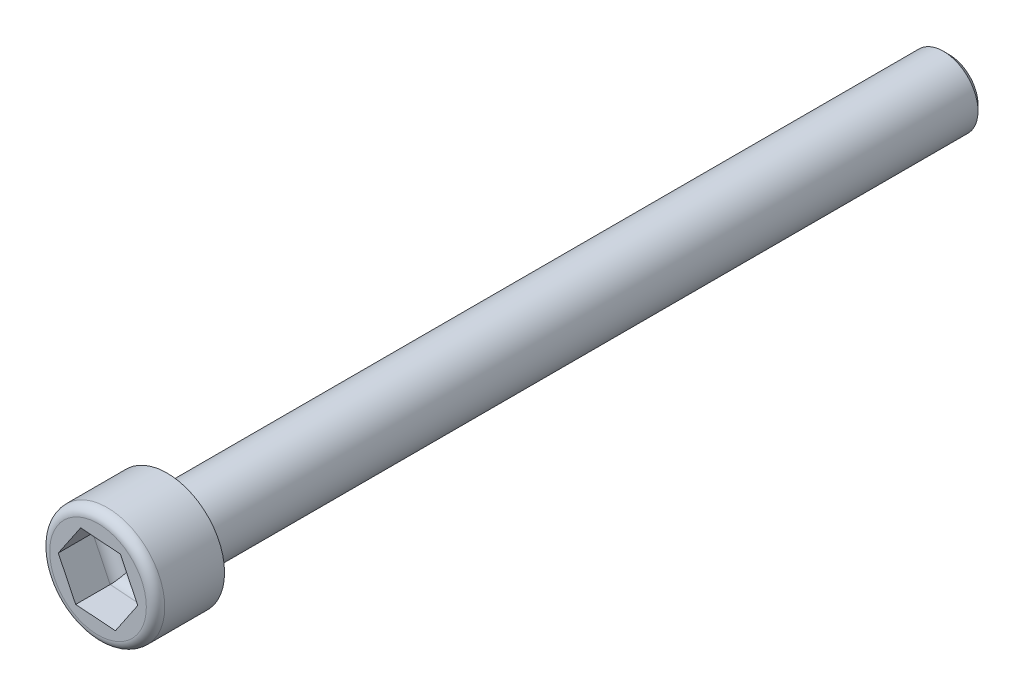
ISO-10303-21;
HEADER;
FILE_DESCRIPTION(('STEP AP214'),'2;1');
FILE_NAME('part.step','',(''),(''),'','','');
FILE_SCHEMA(('AUTOMOTIVE_DESIGN { 1 0 10303 214 1 1 1 1 }'));
ENDSEC;
DATA;
#1=APPLICATION_CONTEXT('core data for automotive mechanical design processes');
#2=APPLICATION_PROTOCOL_DEFINITION('international standard','automotive_design',2000,#1);
#3=PRODUCT_CONTEXT('',#1,'mechanical');
#4=PRODUCT('Part','Part','',(#3));
#5=PRODUCT_RELATED_PRODUCT_CATEGORY('part','',(#4));
#6=PRODUCT_DEFINITION_FORMATION('','',#4);
#7=PRODUCT_DEFINITION_CONTEXT('part definition',#1,'design');
#8=PRODUCT_DEFINITION('design','',#6,#7);
#9=PRODUCT_DEFINITION_SHAPE('','',#8);
#10=(LENGTH_UNIT() NAMED_UNIT(*) SI_UNIT(.MILLI.,.METRE.));
#11=(NAMED_UNIT(*) PLANE_ANGLE_UNIT() SI_UNIT($,.RADIAN.));
#12=(NAMED_UNIT(*) SI_UNIT($,.STERADIAN.) SOLID_ANGLE_UNIT());
#13=UNCERTAINTY_MEASURE_WITH_UNIT(LENGTH_MEASURE(1.E-05),#10,'distance_accuracy_value','');
#14=(GEOMETRIC_REPRESENTATION_CONTEXT(3) GLOBAL_UNCERTAINTY_ASSIGNED_CONTEXT((#13)) GLOBAL_UNIT_ASSIGNED_CONTEXT((#10,
#11,#12)) REPRESENTATION_CONTEXT('',''));
#15=CARTESIAN_POINT('',(0.,0.,0.));
#16=DIRECTION('',(0.,0.,1.));
#17=DIRECTION('',(1.,0.,0.));
#18=AXIS2_PLACEMENT_3D('',#15,#16,#17);
#19=CARTESIAN_POINT('',(0.,0.,34.));
#20=DIRECTION('',(0.,0.,-1.));
#21=DIRECTION('',(-1.,0.,0.));
#22=AXIS2_PLACEMENT_3D('',#19,#20,#21);
#23=CYLINDRICAL_SURFACE('',#22,1.5);
#24=CARTESIAN_POINT('',(0.,0.,0.25));
#25=DIRECTION('',(0.,0.,1.));
#26=DIRECTION('',(1.,0.,0.));
#27=AXIS2_PLACEMENT_3D('',#24,#25,#26);
#28=CIRCLE('',#27,1.5);
#29=CARTESIAN_POINT('',(1.5,0.,0.25));
#30=VERTEX_POINT('',#29);
#31=EDGE_CURVE('E155',#30,#30,#28,.T.);
#32=ORIENTED_EDGE('',*,*,#31,.T.);
#33=EDGE_LOOP('',(#32));
#34=FACE_BOUND('',#33,.T.);
#35=CARTESIAN_POINT('',(0.,0.,34.));
#36=DIRECTION('',(0.,0.,1.));
#37=DIRECTION('',(1.,0.,0.));
#38=AXIS2_PLACEMENT_3D('',#35,#36,#37);
#39=CIRCLE('',#38,1.5);
#40=CARTESIAN_POINT('',(1.5,0.,34.));
#41=VERTEX_POINT('',#40);
#42=EDGE_CURVE('E146',#41,#41,#39,.T.);
#43=ORIENTED_EDGE('',*,*,#42,.F.);
#44=EDGE_LOOP('',(#43));
#45=FACE_BOUND('',#44,.T.);
#46=ADVANCED_FACE('F33',(#34,#45),#23,.T.);
#47=CARTESIAN_POINT('',(0.,0.,0.));
#48=DIRECTION('',(0.,0.,1.));
#49=DIRECTION('',(1.,0.,0.));
#50=AXIS2_PLACEMENT_3D('',#47,#48,#49);
#51=PLANE('',#50);
#52=CARTESIAN_POINT('',(0.,0.,0.));
#53=DIRECTION('',(0.,0.,1.));
#54=DIRECTION('',(1.,0.,0.));
#55=AXIS2_PLACEMENT_3D('',#52,#53,#54);
#56=CIRCLE('',#55,1.25);
#57=CARTESIAN_POINT('',(1.25,0.,0.));
#58=VERTEX_POINT('',#57);
#59=EDGE_CURVE('E158',#58,#58,#56,.F.);
#60=ORIENTED_EDGE('',*,*,#59,.T.);
#61=EDGE_LOOP('',(#60));
#62=FACE_BOUND('',#61,.T.);
#63=ADVANCED_FACE('F248',(#62),#51,.F.);
#64=CARTESIAN_POINT('',(0.,0.,34.));
#65=DIRECTION('',(0.,0.,1.));
#66=DIRECTION('',(1.,0.,0.));
#67=AXIS2_PLACEMENT_3D('',#64,#65,#66);
#68=PLANE('',#67);
#69=CARTESIAN_POINT('',(0.,0.,34.));
#70=DIRECTION('',(0.,0.,1.));
#71=DIRECTION('',(1.,0.,0.));
#72=AXIS2_PLACEMENT_3D('',#69,#70,#71);
#73=CIRCLE('',#72,2.5);
#74=CARTESIAN_POINT('',(2.5,0.,34.));
#75=VERTEX_POINT('',#74);
#76=EDGE_CURVE('E137',#75,#75,#73,.T.);
#77=ORIENTED_EDGE('',*,*,#76,.F.);
#78=EDGE_LOOP('',(#77));
#79=FACE_BOUND('',#78,.T.);
#80=ORIENTED_EDGE('',*,*,#42,.T.);
#81=EDGE_LOOP('',(#80));
#82=FACE_BOUND('',#81,.T.);
#83=ADVANCED_FACE('F254',(#79,#82),#68,.F.);
#84=CARTESIAN_POINT('',(0.,0.,37.));
#85=DIRECTION('',(0.,0.,-1.));
#86=DIRECTION('',(-1.,0.,0.));
#87=AXIS2_PLACEMENT_3D('',#84,#85,#86);
#88=CYLINDRICAL_SURFACE('',#87,2.5);
#89=CARTESIAN_POINT('',(0.,0.,36.6));
#90=DIRECTION('',(0.,0.,1.));
#91=DIRECTION('',(1.,0.,0.));
#92=AXIS2_PLACEMENT_3D('',#89,#90,#91);
#93=CIRCLE('',#92,2.5);
#94=CARTESIAN_POINT('',(2.5,0.,36.6));
#95=VERTEX_POINT('',#94);
#96=EDGE_CURVE('E152',#95,#95,#93,.F.);
#97=ORIENTED_EDGE('',*,*,#96,.T.);
#98=EDGE_LOOP('',(#97));
#99=FACE_BOUND('',#98,.T.);
#100=ORIENTED_EDGE('',*,*,#76,.T.);
#101=EDGE_LOOP('',(#100));
#102=FACE_BOUND('',#101,.T.);
#103=ADVANCED_FACE('F310',(#99,#102),#88,.T.);
#104=CARTESIAN_POINT('',(0.,0.,37.));
#105=DIRECTION('',(0.,0.,1.));
#106=DIRECTION('',(1.,0.,0.));
#107=AXIS2_PLACEMENT_3D('',#104,#105,#106);
#108=PLANE('',#107);
#109=CARTESIAN_POINT('',(0.,0.,37.));
#110=DIRECTION('',(0.,0.,1.));
#111=DIRECTION('',(1.,0.,0.));
#112=AXIS2_PLACEMENT_3D('',#109,#110,#111);
#113=CIRCLE('',#112,2.1);
#114=CARTESIAN_POINT('',(2.1,0.,37.));
#115=VERTEX_POINT('',#114);
#116=EDGE_CURVE('E149',#115,#115,#113,.T.);
#117=ORIENTED_EDGE('',*,*,#116,.T.);
#118=EDGE_LOOP('',(#117));
#119=FACE_BOUND('',#118,.T.);
#120=DIRECTION('',(0.560793935246234,0.827955410750508,0.));
#121=VECTOR('',#120,1.);
#122=CARTESIAN_POINT('',(0.756271321914277,-1.55822132178007,37.));
#123=LINE('',#122,#121);
#124=CARTESIAN_POINT('',(0.756271321914277,-1.55822132178007,37.));
#125=VERTEX_POINT('',#124);
#126=CARTESIAN_POINT('',(1.72759491033725,-0.124160483958632,37.));
#127=VERTEX_POINT('',#126);
#128=EDGE_CURVE('E119',#125,#127,#123,.T.);
#129=ORIENTED_EDGE('',*,*,#128,.F.);
#130=DIRECTION('',(0.997427386533836,-0.0716840888362304,0.));
#131=VECTOR('',#130,1.);
#132=CARTESIAN_POINT('',(-0.971323588422969,-1.43406083782144,37.));
#133=LINE('',#132,#131);
#134=CARTESIAN_POINT('',(-0.971323588422969,-1.43406083782144,37.));
#135=VERTEX_POINT('',#134);
#136=EDGE_CURVE('E132',#135,#125,#133,.T.);
#137=ORIENTED_EDGE('',*,*,#136,.F.);
#138=DIRECTION('',(0.436633451287602,-0.899639499586738,0.));
#139=VECTOR('',#138,1.);
#140=CARTESIAN_POINT('',(-1.72759491033725,0.124160483958632,37.));
#141=LINE('',#140,#139);
#142=CARTESIAN_POINT('',(-1.72759491033725,0.124160483958632,37.));
#143=VERTEX_POINT('',#142);
#144=EDGE_CURVE('E126',#143,#135,#141,.T.);
#145=ORIENTED_EDGE('',*,*,#144,.F.);
#146=DIRECTION('',(-0.560793935246234,-0.827955410750508,0.));
#147=VECTOR('',#146,1.);
#148=CARTESIAN_POINT('',(-0.756271321914277,1.55822132178007,37.));
#149=LINE('',#148,#147);
#150=CARTESIAN_POINT('',(-0.756271321914277,1.55822132178007,37.));
#151=VERTEX_POINT('',#150);
#152=EDGE_CURVE('E124',#151,#143,#149,.T.);
#153=ORIENTED_EDGE('',*,*,#152,.F.);
#154=DIRECTION('',(-0.997427386533837,0.0716840888362305,0.));
#155=VECTOR('',#154,1.);
#156=CARTESIAN_POINT('',(0.971323588422968,1.43406083782144,37.));
#157=LINE('',#156,#155);
#158=CARTESIAN_POINT('',(0.971323588422968,1.43406083782144,37.));
#159=VERTEX_POINT('',#158);
#160=EDGE_CURVE('E107',#159,#151,#157,.T.);
#161=ORIENTED_EDGE('',*,*,#160,.F.);
#162=DIRECTION('',(-0.436633451287602,0.899639499586738,0.));
#163=VECTOR('',#162,1.);
#164=CARTESIAN_POINT('',(1.72759491033725,-0.124160483958632,37.));
#165=LINE('',#164,#163);
#166=EDGE_CURVE('E114',#127,#159,#165,.T.);
#167=ORIENTED_EDGE('',*,*,#166,.F.);
#168=EDGE_LOOP('',(#129,#137,#145,#153,#161,#167));
#169=FACE_BOUND('',#168,.T.);
#170=ADVANCED_FACE('F121',(#119,#169),#108,.T.);
#171=CARTESIAN_POINT('',(0.756271321914277,-1.55822132178007,35.));
#172=DIRECTION('',(0.827955410750508,-0.560793935246234,0.));
#173=DIRECTION('',(0.560793935246234,0.827955410750508,0.));
#174=AXIS2_PLACEMENT_3D('',#171,#172,#173);
#175=PLANE('',#174);
#176=DIRECTION('',(0.,0.,1.));
#177=VECTOR('',#176,1.);
#178=CARTESIAN_POINT('',(1.72759491033725,-0.124160483958632,35.));
#179=LINE('',#178,#177);
#180=CARTESIAN_POINT('',(1.72759491033725,-0.124160483958632,35.5));
#181=VERTEX_POINT('',#180);
#182=EDGE_CURVE('E111',#181,#127,#179,.T.);
#183=ORIENTED_EDGE('',*,*,#182,.F.);
#184=DIRECTION('',(0.560793935246234,0.827955410750508,0.));
#185=VECTOR('',#184,1.);
#186=CARTESIAN_POINT('',(0.756271321914277,-1.55822132178007,35.5));
#187=LINE('',#186,#185);
#188=CARTESIAN_POINT('',(0.756271321914277,-1.55822132178007,35.5));
#189=VERTEX_POINT('',#188);
#190=EDGE_CURVE('E11',#181,#189,#187,.F.);
#191=ORIENTED_EDGE('',*,*,#190,.T.);
#192=DIRECTION('',(0.,0.,1.));
#193=VECTOR('',#192,1.);
#194=CARTESIAN_POINT('',(0.756271321914277,-1.55822132178007,35.));
#195=LINE('',#194,#193);
#196=EDGE_CURVE('E135',#189,#125,#195,.T.);
#197=ORIENTED_EDGE('',*,*,#196,.T.);
#198=ORIENTED_EDGE('',*,*,#128,.T.);
#199=EDGE_LOOP('',(#183,#191,#197,#198));
#200=FACE_BOUND('',#199,.T.);
#201=ADVANCED_FACE('F202',(#200),#175,.F.);
#202=CARTESIAN_POINT('',(-0.971323588422969,-1.43406083782144,35.));
#203=DIRECTION('',(-0.0716840888362304,-0.997427386533837,0.));
#204=DIRECTION('',(0.997427386533837,-0.0716840888362304,0.));
#205=AXIS2_PLACEMENT_3D('',#202,#203,#204);
#206=PLANE('',#205);
#207=ORIENTED_EDGE('',*,*,#196,.F.);
#208=DIRECTION('',(0.997427386533837,-0.0716840888362304,0.));
#209=VECTOR('',#208,1.);
#210=CARTESIAN_POINT('',(-0.971323588422969,-1.43406083782144,35.5));
#211=LINE('',#210,#209);
#212=CARTESIAN_POINT('',(-0.971323588422969,-1.43406083782144,35.5));
#213=VERTEX_POINT('',#212);
#214=EDGE_CURVE('E174',#189,#213,#211,.F.);
#215=ORIENTED_EDGE('',*,*,#214,.T.);
#216=DIRECTION('',(0.,0.,1.));
#217=VECTOR('',#216,1.);
#218=CARTESIAN_POINT('',(-0.971323588422969,-1.43406083782144,35.));
#219=LINE('',#218,#217);
#220=EDGE_CURVE('E138',#213,#135,#219,.T.);
#221=ORIENTED_EDGE('',*,*,#220,.T.);
#222=ORIENTED_EDGE('',*,*,#136,.T.);
#223=EDGE_LOOP('',(#207,#215,#221,#222));
#224=FACE_BOUND('',#223,.T.);
#225=ADVANCED_FACE('F207',(#224),#206,.F.);
#226=CARTESIAN_POINT('',(-1.72759491033725,0.124160483958632,35.));
#227=DIRECTION('',(-0.899639499586738,-0.436633451287602,0.));
#228=DIRECTION('',(0.436633451287602,-0.899639499586739,0.));
#229=AXIS2_PLACEMENT_3D('',#226,#227,#228);
#230=PLANE('',#229);
#231=ORIENTED_EDGE('',*,*,#220,.F.);
#232=DIRECTION('',(0.436633451287602,-0.899639499586739,0.));
#233=VECTOR('',#232,1.);
#234=CARTESIAN_POINT('',(-1.72759491033725,0.124160483958632,35.5));
#235=LINE('',#234,#233);
#236=CARTESIAN_POINT('',(-1.72759491033725,0.124160483958632,35.5));
#237=VERTEX_POINT('',#236);
#238=EDGE_CURVE('E177',#213,#237,#235,.F.);
#239=ORIENTED_EDGE('',*,*,#238,.T.);
#240=DIRECTION('',(0.,0.,1.));
#241=VECTOR('',#240,1.);
#242=CARTESIAN_POINT('',(-1.72759491033725,0.124160483958632,35.));
#243=LINE('',#242,#241);
#244=EDGE_CURVE('E140',#237,#143,#243,.T.);
#245=ORIENTED_EDGE('',*,*,#244,.T.);
#246=ORIENTED_EDGE('',*,*,#144,.T.);
#247=EDGE_LOOP('',(#231,#239,#245,#246));
#248=FACE_BOUND('',#247,.T.);
#249=ADVANCED_FACE('F211',(#248),#230,.F.);
#250=CARTESIAN_POINT('',(-0.756271321914277,1.55822132178007,35.));
#251=DIRECTION('',(-0.827955410750508,0.560793935246234,0.));
#252=DIRECTION('',(-0.560793935246234,-0.827955410750508,0.));
#253=AXIS2_PLACEMENT_3D('',#250,#251,#252);
#254=PLANE('',#253);
#255=ORIENTED_EDGE('',*,*,#244,.F.);
#256=DIRECTION('',(-0.560793935246234,-0.827955410750508,0.));
#257=VECTOR('',#256,1.);
#258=CARTESIAN_POINT('',(-0.756271321914277,1.55822132178007,35.5));
#259=LINE('',#258,#257);
#260=CARTESIAN_POINT('',(-0.756271321914277,1.55822132178007,35.5));
#261=VERTEX_POINT('',#260);
#262=EDGE_CURVE('E179',#237,#261,#259,.F.);
#263=ORIENTED_EDGE('',*,*,#262,.T.);
#264=DIRECTION('',(0.,0.,1.));
#265=VECTOR('',#264,1.);
#266=CARTESIAN_POINT('',(-0.756271321914277,1.55822132178007,35.));
#267=LINE('',#266,#265);
#268=EDGE_CURVE('E110',#261,#151,#267,.T.);
#269=ORIENTED_EDGE('',*,*,#268,.T.);
#270=ORIENTED_EDGE('',*,*,#152,.T.);
#271=EDGE_LOOP('',(#255,#263,#269,#270));
#272=FACE_BOUND('',#271,.T.);
#273=ADVANCED_FACE('F215',(#272),#254,.F.);
#274=CARTESIAN_POINT('',(0.971323588422968,1.43406083782144,35.));
#275=DIRECTION('',(0.0716840888362305,0.997427386533837,0.));
#276=DIRECTION('',(-0.997427386533837,0.0716840888362305,0.));
#277=AXIS2_PLACEMENT_3D('',#274,#275,#276);
#278=PLANE('',#277);
#279=ORIENTED_EDGE('',*,*,#268,.F.);
#280=DIRECTION('',(-0.997427386533837,0.0716840888362305,0.));
#281=VECTOR('',#280,1.);
#282=CARTESIAN_POINT('',(0.971323588422968,1.43406083782144,35.5));
#283=LINE('',#282,#281);
#284=CARTESIAN_POINT('',(0.971323588422968,1.43406083782144,35.5));
#285=VERTEX_POINT('',#284);
#286=EDGE_CURVE('E57',#261,#285,#283,.F.);
#287=ORIENTED_EDGE('',*,*,#286,.T.);
#288=DIRECTION('',(0.,0.,1.));
#289=VECTOR('',#288,1.);
#290=CARTESIAN_POINT('',(0.971323588422968,1.43406083782144,35.));
#291=LINE('',#290,#289);
#292=EDGE_CURVE('E103',#285,#159,#291,.T.);
#293=ORIENTED_EDGE('',*,*,#292,.T.);
#294=ORIENTED_EDGE('',*,*,#160,.T.);
#295=EDGE_LOOP('',(#279,#287,#293,#294));
#296=FACE_BOUND('',#295,.T.);
#297=ADVANCED_FACE('F105',(#296),#278,.F.);
#298=CARTESIAN_POINT('',(1.72759491033725,-0.124160483958632,35.));
#299=DIRECTION('',(0.899639499586738,0.436633451287602,0.));
#300=DIRECTION('',(-0.436633451287602,0.899639499586738,0.));
#301=AXIS2_PLACEMENT_3D('',#298,#299,#300);
#302=PLANE('',#301);
#303=ORIENTED_EDGE('',*,*,#292,.F.);
#304=DIRECTION('',(-0.436633451287602,0.899639499586738,0.));
#305=VECTOR('',#304,1.);
#306=CARTESIAN_POINT('',(1.72759491033725,-0.124160483958632,35.5));
#307=LINE('',#306,#305);
#308=EDGE_CURVE('E42',#285,#181,#307,.F.);
#309=ORIENTED_EDGE('',*,*,#308,.T.);
#310=ORIENTED_EDGE('',*,*,#182,.T.);
#311=ORIENTED_EDGE('',*,*,#166,.T.);
#312=EDGE_LOOP('',(#303,#309,#310,#311));
#313=FACE_BOUND('',#312,.T.);
#314=ADVANCED_FACE('F115',(#313),#302,.F.);
#315=CARTESIAN_POINT('',(0.,0.,35.));
#316=DIRECTION('',(0.,0.,1.));
#317=DIRECTION('',(1.,0.,0.));
#318=AXIS2_PLACEMENT_3D('',#315,#316,#317);
#319=PLANE('',#318);
#320=DIRECTION('',(0.436633451287602,-0.899639499586739,0.));
#321=VECTOR('',#320,1.);
#322=CARTESIAN_POINT('',(-0.899639499586738,-0.436633451287602,35.));
#323=LINE('',#322,#321);
#324=CARTESIAN_POINT('',(-1.15172994022483,0.0827736559724214,35.));
#325=VERTEX_POINT('',#324);
#326=CARTESIAN_POINT('',(-0.647549058948646,-0.956040558547625,35.));
#327=VERTEX_POINT('',#326);
#328=EDGE_CURVE('E169',#325,#327,#323,.T.);
#329=ORIENTED_EDGE('',*,*,#328,.T.);
#330=DIRECTION('',(0.997427386533837,-0.0716840888362304,0.));
#331=VECTOR('',#330,1.);
#332=CARTESIAN_POINT('',(-0.0716840888362304,-0.997427386533836,35.));
#333=LINE('',#332,#331);
#334=CARTESIAN_POINT('',(0.504180881276184,-1.03881421452005,35.));
#335=VERTEX_POINT('',#334);
#336=EDGE_CURVE('E171',#327,#335,#333,.T.);
#337=ORIENTED_EDGE('',*,*,#336,.T.);
#338=DIRECTION('',(0.560793935246234,0.827955410750508,0.));
#339=VECTOR('',#338,1.);
#340=CARTESIAN_POINT('',(0.827955410750507,-0.560793935246234,35.));
#341=LINE('',#340,#339);
#342=CARTESIAN_POINT('',(1.15172994022483,-0.0827736559724207,35.));
#343=VERTEX_POINT('',#342);
#344=EDGE_CURVE('E161',#335,#343,#341,.T.);
#345=ORIENTED_EDGE('',*,*,#344,.T.);
#346=DIRECTION('',(-0.436633451287602,0.899639499586738,0.));
#347=VECTOR('',#346,1.);
#348=CARTESIAN_POINT('',(0.899639499586738,0.436633451287602,35.));
#349=LINE('',#348,#347);
#350=CARTESIAN_POINT('',(0.647549058948645,0.956040558547626,35.));
#351=VERTEX_POINT('',#350);
#352=EDGE_CURVE('E163',#343,#351,#349,.T.);
#353=ORIENTED_EDGE('',*,*,#352,.T.);
#354=DIRECTION('',(-0.997427386533837,0.0716840888362305,0.));
#355=VECTOR('',#354,1.);
#356=CARTESIAN_POINT('',(0.0716840888362305,0.997427386533836,35.));
#357=LINE('',#356,#355);
#358=CARTESIAN_POINT('',(-0.504180881276185,1.03881421452005,35.));
#359=VERTEX_POINT('',#358);
#360=EDGE_CURVE('E165',#351,#359,#357,.T.);
#361=ORIENTED_EDGE('',*,*,#360,.T.);
#362=DIRECTION('',(-0.560793935246234,-0.827955410750508,0.));
#363=VECTOR('',#362,1.);
#364=CARTESIAN_POINT('',(-0.827955410750508,0.560793935246234,35.));
#365=LINE('',#364,#363);
#366=EDGE_CURVE('E167',#359,#325,#365,.T.);
#367=ORIENTED_EDGE('',*,*,#366,.T.);
#368=EDGE_LOOP('',(#329,#337,#345,#353,#361,#367));
#369=FACE_BOUND('',#368,.T.);
#370=ADVANCED_FACE('F234',(#369),#319,.T.);
#371=CARTESIAN_POINT('',(0.,0.,36.6));
#372=DIRECTION('',(0.,0.,1.));
#373=DIRECTION('',(1.,0.,0.));
#374=AXIS2_PLACEMENT_3D('',#371,#372,#373);
#375=TOROIDAL_SURFACE('',#374,2.1,0.4);
#376=ORIENTED_EDGE('',*,*,#96,.F.);
#377=EDGE_LOOP('',(#376));
#378=FACE_BOUND('',#377,.T.);
#379=ORIENTED_EDGE('',*,*,#116,.F.);
#380=EDGE_LOOP('',(#379));
#381=FACE_BOUND('',#380,.T.);
#382=ADVANCED_FACE('F236',(#378,#381),#375,.T.);
#383=CARTESIAN_POINT('',(0.,0.,0.25));
#384=DIRECTION('',(0.,0.,1.));
#385=DIRECTION('',(1.,0.,0.));
#386=AXIS2_PLACEMENT_3D('',#383,#384,#385);
#387=CONICAL_SURFACE('',#386,1.5,0.785398163397438);
#388=ORIENTED_EDGE('',*,*,#59,.F.);
#389=EDGE_LOOP('',(#388));
#390=FACE_BOUND('',#389,.T.);
#391=ORIENTED_EDGE('',*,*,#31,.F.);
#392=EDGE_LOOP('',(#391));
#393=FACE_BOUND('',#392,.T.);
#394=ADVANCED_FACE('F242',(#390,#393),#387,.T.);
#395=CARTESIAN_POINT('',(0.0716840888362305,0.997427386533836,35.5));
#396=DIRECTION('',(-0.997427386533837,0.0716840888362305,0.));
#397=DIRECTION('',(-0.0716840888362305,-0.997427386533837,0.));
#398=AXIS2_PLACEMENT_3D('',#395,#396,#397);
#399=CYLINDRICAL_SURFACE('',#398,0.5);
#400=CARTESIAN_POINT('',(0.647549058948645,0.956040558547626,35.5));
#401=DIRECTION('',(-0.827955410750508,0.560793935246234,0.));
#402=DIRECTION('',(-0.560793935246234,-0.827955410750508,0.));
#403=AXIS2_PLACEMENT_3D('',#400,#401,#402);
#404=ELLIPSE('',#403,0.577350269189626,0.5);
#405=EDGE_CURVE('E192',#285,#351,#404,.T.);
#406=ORIENTED_EDGE('',*,*,#405,.F.);
#407=ORIENTED_EDGE('',*,*,#286,.F.);
#408=CARTESIAN_POINT('',(-0.504180881276185,1.03881421452005,35.5));
#409=DIRECTION('',(-0.899639499586739,-0.436633451287602,0.));
#410=DIRECTION('',(0.436633451287602,-0.899639499586738,0.));
#411=AXIS2_PLACEMENT_3D('',#408,#409,#410);
#412=ELLIPSE('',#411,0.577350269189626,0.5);
#413=EDGE_CURVE('E37',#359,#261,#412,.F.);
#414=ORIENTED_EDGE('',*,*,#413,.F.);
#415=ORIENTED_EDGE('',*,*,#360,.F.);
#416=EDGE_LOOP('',(#406,#407,#414,#415));
#417=FACE_BOUND('',#416,.T.);
#418=ADVANCED_FACE('F35',(#417),#399,.F.);
#419=CARTESIAN_POINT('',(-0.827955410750508,0.560793935246234,35.5));
#420=DIRECTION('',(-0.560793935246234,-0.827955410750508,0.));
#421=DIRECTION('',(0.827955410750508,-0.560793935246234,0.));
#422=AXIS2_PLACEMENT_3D('',#419,#420,#421);
#423=CYLINDRICAL_SURFACE('',#422,0.5);
#424=ORIENTED_EDGE('',*,*,#413,.T.);
#425=ORIENTED_EDGE('',*,*,#262,.F.);
#426=CARTESIAN_POINT('',(-1.15172994022483,0.0827736559724214,35.5));
#427=DIRECTION('',(-0.0716840888362304,-0.997427386533837,0.));
#428=DIRECTION('',(0.997427386533837,-0.0716840888362306,0.));
#429=AXIS2_PLACEMENT_3D('',#426,#427,#428);
#430=ELLIPSE('',#429,0.577350269189626,0.5);
#431=EDGE_CURVE('E190',#325,#237,#430,.F.);
#432=ORIENTED_EDGE('',*,*,#431,.F.);
#433=ORIENTED_EDGE('',*,*,#366,.F.);
#434=EDGE_LOOP('',(#424,#425,#432,#433));
#435=FACE_BOUND('',#434,.T.);
#436=ADVANCED_FACE('F232',(#435),#423,.F.);
#437=CARTESIAN_POINT('',(0.899639499586738,0.436633451287602,35.5));
#438=DIRECTION('',(-0.436633451287602,0.899639499586738,0.));
#439=DIRECTION('',(-0.899639499586738,-0.436633451287602,0.));
#440=AXIS2_PLACEMENT_3D('',#437,#438,#439);
#441=CYLINDRICAL_SURFACE('',#440,0.5);
#442=ORIENTED_EDGE('',*,*,#405,.T.);
#443=ORIENTED_EDGE('',*,*,#352,.F.);
#444=CARTESIAN_POINT('',(1.15172994022483,-0.0827736559724207,35.5));
#445=DIRECTION('',(0.0716840888362303,0.997427386533837,0.));
#446=DIRECTION('',(-0.997427386533837,0.0716840888362305,0.));
#447=AXIS2_PLACEMENT_3D('',#444,#445,#446);
#448=ELLIPSE('',#447,0.577350269189626,0.5);
#449=EDGE_CURVE('E187',#181,#343,#448,.T.);
#450=ORIENTED_EDGE('',*,*,#449,.F.);
#451=ORIENTED_EDGE('',*,*,#308,.F.);
#452=EDGE_LOOP('',(#442,#443,#450,#451));
#453=FACE_BOUND('',#452,.T.);
#454=ADVANCED_FACE('F218',(#453),#441,.F.);
#455=CARTESIAN_POINT('',(-0.899639499586738,-0.436633451287602,35.5));
#456=DIRECTION('',(0.436633451287602,-0.899639499586739,0.));
#457=DIRECTION('',(0.899639499586738,0.436633451287602,0.));
#458=AXIS2_PLACEMENT_3D('',#455,#456,#457);
#459=CYLINDRICAL_SURFACE('',#458,0.5);
#460=ORIENTED_EDGE('',*,*,#431,.T.);
#461=ORIENTED_EDGE('',*,*,#238,.F.);
#462=CARTESIAN_POINT('',(-0.647549058948645,-0.956040558547626,35.5));
#463=DIRECTION('',(0.827955410750508,-0.560793935246234,0.));
#464=DIRECTION('',(0.560793935246234,0.827955410750508,0.));
#465=AXIS2_PLACEMENT_3D('',#462,#463,#464);
#466=ELLIPSE('',#465,0.577350269189626,0.5);
#467=EDGE_CURVE('E185',#327,#213,#466,.F.);
#468=ORIENTED_EDGE('',*,*,#467,.F.);
#469=ORIENTED_EDGE('',*,*,#328,.F.);
#470=EDGE_LOOP('',(#460,#461,#468,#469));
#471=FACE_BOUND('',#470,.T.);
#472=ADVANCED_FACE('F230',(#471),#459,.F.);
#473=CARTESIAN_POINT('',(0.827955410750507,-0.560793935246234,35.5));
#474=DIRECTION('',(0.560793935246234,0.827955410750508,0.));
#475=DIRECTION('',(-0.827955410750508,0.560793935246234,0.));
#476=AXIS2_PLACEMENT_3D('',#473,#474,#475);
#477=CYLINDRICAL_SURFACE('',#476,0.5);
#478=ORIENTED_EDGE('',*,*,#449,.T.);
#479=ORIENTED_EDGE('',*,*,#344,.F.);
#480=CARTESIAN_POINT('',(0.504180881276184,-1.03881421452005,35.5));
#481=DIRECTION('',(0.899639499586738,0.436633451287602,0.));
#482=DIRECTION('',(0.436633451287602,-0.899639499586738,0.));
#483=AXIS2_PLACEMENT_3D('',#480,#481,#482);
#484=ELLIPSE('',#483,0.577350269189626,0.5);
#485=EDGE_CURVE('E183',#189,#335,#484,.T.);
#486=ORIENTED_EDGE('',*,*,#485,.F.);
#487=ORIENTED_EDGE('',*,*,#190,.F.);
#488=EDGE_LOOP('',(#478,#479,#486,#487));
#489=FACE_BOUND('',#488,.T.);
#490=ADVANCED_FACE('F223',(#489),#477,.F.);
#491=CARTESIAN_POINT('',(-0.0716840888362304,-0.997427386533836,35.5));
#492=DIRECTION('',(0.997427386533837,-0.0716840888362304,0.));
#493=DIRECTION('',(0.0716840888362304,0.997427386533837,0.));
#494=AXIS2_PLACEMENT_3D('',#491,#492,#493);
#495=CYLINDRICAL_SURFACE('',#494,0.5);
#496=ORIENTED_EDGE('',*,*,#467,.T.);
#497=ORIENTED_EDGE('',*,*,#214,.F.);
#498=ORIENTED_EDGE('',*,*,#485,.T.);
#499=ORIENTED_EDGE('',*,*,#336,.F.);
#500=EDGE_LOOP('',(#496,#497,#498,#499));
#501=FACE_BOUND('',#500,.T.);
#502=ADVANCED_FACE('F226',(#501),#495,.F.);
#503=CLOSED_SHELL('',(#46,#63,#83,#103,#170,#201,#225,#249,#273,#297,#314,#370,#382,#394,#418,
#436,#454,#472,#490,#502));
#504=MANIFOLD_SOLID_BREP('B2',#503);
#505=ADVANCED_BREP_SHAPE_REPRESENTATION('',(#18,#504),#14);
#506=SHAPE_DEFINITION_REPRESENTATION(#9,#505);
ENDSEC;
END-ISO-10303-21;
